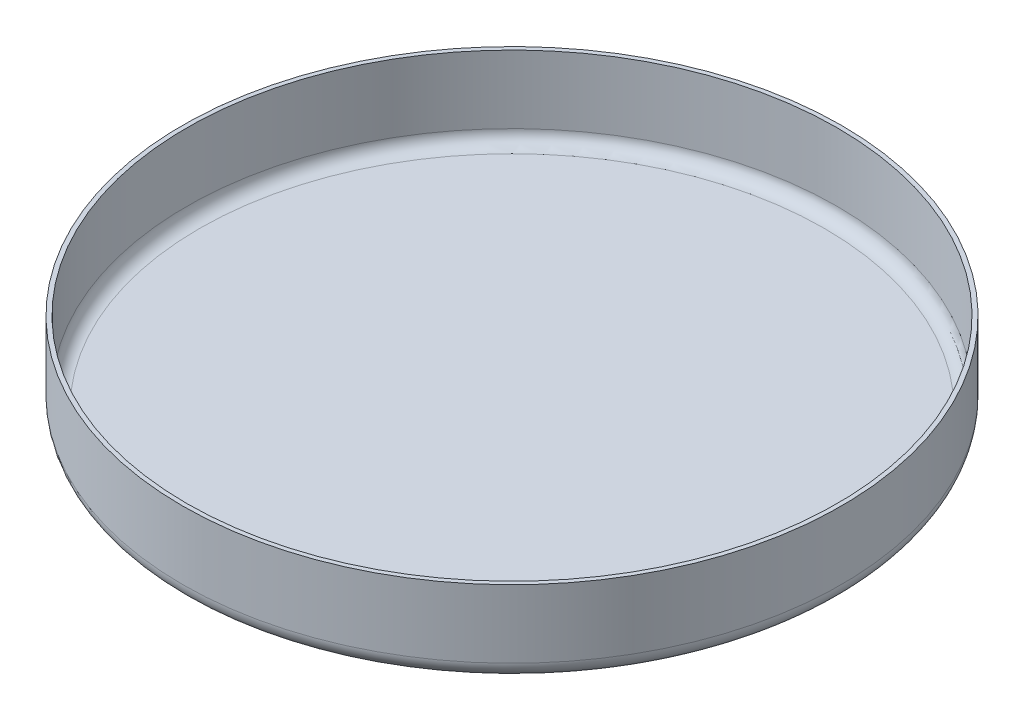
ISO-10303-21;
HEADER;
FILE_DESCRIPTION(('STEP AP214'),'2;1');
FILE_NAME('part.step','',(''),(''),'','','');
FILE_SCHEMA(('AUTOMOTIVE_DESIGN { 1 0 10303 214 1 1 1 1 }'));
ENDSEC;
DATA;
#1=APPLICATION_CONTEXT('core data for automotive mechanical design processes');
#2=APPLICATION_PROTOCOL_DEFINITION('international standard','automotive_design',2000,#1);
#3=PRODUCT_CONTEXT('',#1,'mechanical');
#4=PRODUCT('Part','Part','',(#3));
#5=PRODUCT_RELATED_PRODUCT_CATEGORY('part','',(#4));
#6=PRODUCT_DEFINITION_FORMATION('','',#4);
#7=PRODUCT_DEFINITION_CONTEXT('part definition',#1,'design');
#8=PRODUCT_DEFINITION('design','',#6,#7);
#9=PRODUCT_DEFINITION_SHAPE('','',#8);
#10=(LENGTH_UNIT() NAMED_UNIT(*) SI_UNIT(.MILLI.,.METRE.));
#11=(NAMED_UNIT(*) PLANE_ANGLE_UNIT() SI_UNIT($,.RADIAN.));
#12=(NAMED_UNIT(*) SI_UNIT($,.STERADIAN.) SOLID_ANGLE_UNIT());
#13=UNCERTAINTY_MEASURE_WITH_UNIT(LENGTH_MEASURE(1.E-05),#10,'distance_accuracy_value','');
#14=(GEOMETRIC_REPRESENTATION_CONTEXT(3) GLOBAL_UNCERTAINTY_ASSIGNED_CONTEXT((#13)) GLOBAL_UNIT_ASSIGNED_CONTEXT((#10,
#11,#12)) REPRESENTATION_CONTEXT('',''));
#15=CARTESIAN_POINT('',(0.,0.,0.));
#16=DIRECTION('',(0.,0.,1.));
#17=DIRECTION('',(1.,0.,0.));
#18=AXIS2_PLACEMENT_3D('',#15,#16,#17);
#19=CARTESIAN_POINT('',(0.,-0.999999999999995,0.));
#20=DIRECTION('',(0.,1.,0.));
#21=DIRECTION('',(0.,0.,1.));
#22=AXIS2_PLACEMENT_3D('',#19,#20,#21);
#23=PLANE('',#22);
#24=CARTESIAN_POINT('',(0.,-0.999999999999995,0.));
#25=DIRECTION('',(0.,1.,0.));
#26=DIRECTION('',(0.,0.,1.));
#27=AXIS2_PLACEMENT_3D('',#24,#25,#26);
#28=CIRCLE('',#27,73.5);
#29=CARTESIAN_POINT('',(0.,-0.999999999999995,73.5));
#30=VERTEX_POINT('',#29);
#31=EDGE_CURVE('E12',#30,#30,#28,.T.);
#32=ORIENTED_EDGE('',*,*,#31,.F.);
#33=EDGE_LOOP('',(#32));
#34=FACE_BOUND('',#33,.T.);
#35=ADVANCED_FACE('F96',(#34),#23,.F.);
#36=CARTESIAN_POINT('',(0.,19.,0.));
#37=DIRECTION('',(0.,-1.,0.));
#38=DIRECTION('',(0.,0.,-1.));
#39=AXIS2_PLACEMENT_3D('',#36,#37,#38);
#40=PLANE('',#39);
#41=CARTESIAN_POINT('',(0.,19.,0.));
#42=DIRECTION('',(0.,1.,0.));
#43=DIRECTION('',(0.,0.,1.));
#44=AXIS2_PLACEMENT_3D('',#41,#42,#43);
#45=CIRCLE('',#44,77.5);
#46=CARTESIAN_POINT('',(0.,19.,77.5));
#47=VERTEX_POINT('',#46);
#48=EDGE_CURVE('E143',#47,#47,#45,.T.);
#49=ORIENTED_EDGE('',*,*,#48,.T.);
#50=EDGE_LOOP('',(#49));
#51=FACE_BOUND('',#50,.T.);
#52=CARTESIAN_POINT('',(0.,19.,0.));
#53=DIRECTION('',(0.,1.,0.));
#54=DIRECTION('',(0.,0.,1.));
#55=AXIS2_PLACEMENT_3D('',#52,#53,#54);
#56=CIRCLE('',#55,76.5);
#57=CARTESIAN_POINT('',(0.,19.,76.5));
#58=VERTEX_POINT('',#57);
#59=EDGE_CURVE('E144',#58,#58,#56,.T.);
#60=ORIENTED_EDGE('',*,*,#59,.F.);
#61=EDGE_LOOP('',(#60));
#62=FACE_BOUND('',#61,.T.);
#63=ADVANCED_FACE('F167',(#51,#62),#40,.F.);
#64=CARTESIAN_POINT('',(0.,0.,0.));
#65=DIRECTION('',(0.,1.,0.));
#66=DIRECTION('',(0.,0.,1.));
#67=AXIS2_PLACEMENT_3D('',#64,#65,#66);
#68=CYLINDRICAL_SURFACE('',#67,76.5);
#69=DIRECTION('',(0.,1.,0.));
#70=VECTOR('',#69,1.);
#71=CARTESIAN_POINT('',(0.,0.,76.5));
#72=LINE('',#71,#70);
#73=CARTESIAN_POINT('',(0.,3.,76.5));
#74=VERTEX_POINT('',#73);
#75=EDGE_CURVE('E153',#74,#58,#72,.T.);
#76=ORIENTED_EDGE('',*,*,#75,.F.);
#77=CARTESIAN_POINT('',(0.,3.,0.));
#78=DIRECTION('',(0.,1.,0.));
#79=DIRECTION('',(0.,0.,1.));
#80=AXIS2_PLACEMENT_3D('',#77,#78,#79);
#81=CIRCLE('',#80,76.5);
#82=EDGE_CURVE('E145',#74,#74,#81,.T.);
#83=ORIENTED_EDGE('',*,*,#82,.F.);
#84=ORIENTED_EDGE('',*,*,#75,.T.);
#85=ORIENTED_EDGE('',*,*,#59,.T.);
#86=EDGE_LOOP('',(#76,#83,#84,#85));
#87=FACE_BOUND('',#86,.T.);
#88=ADVANCED_FACE('F171',(#87),#68,.F.);
#89=CARTESIAN_POINT('',(0.,3.,0.));
#90=DIRECTION('',(0.,1.,0.));
#91=DIRECTION('',(0.,0.,1.));
#92=AXIS2_PLACEMENT_3D('',#89,#90,#91);
#93=TOROIDAL_SURFACE('',#92,73.5,3.);
#94=CARTESIAN_POINT('',(0.,3.,73.5));
#95=DIRECTION('',(1.,0.,0.));
#96=DIRECTION('',(0.,0.,-1.));
#97=AXIS2_PLACEMENT_3D('',#94,#95,#96);
#98=CIRCLE('',#97,3.);
#99=CARTESIAN_POINT('',(0.,0.,73.5));
#100=VERTEX_POINT('',#99);
#101=EDGE_CURVE('E111',#100,#74,#98,.F.);
#102=ORIENTED_EDGE('',*,*,#101,.F.);
#103=CARTESIAN_POINT('',(0.,0.,0.));
#104=DIRECTION('',(0.,1.,0.));
#105=DIRECTION('',(0.,0.,1.));
#106=AXIS2_PLACEMENT_3D('',#103,#104,#105);
#107=CIRCLE('',#106,73.5);
#108=EDGE_CURVE('E150',#100,#100,#107,.T.);
#109=ORIENTED_EDGE('',*,*,#108,.F.);
#110=ORIENTED_EDGE('',*,*,#101,.T.);
#111=ORIENTED_EDGE('',*,*,#82,.T.);
#112=EDGE_LOOP('',(#102,#109,#110,#111));
#113=FACE_BOUND('',#112,.T.);
#114=ADVANCED_FACE('F157',(#113),#93,.F.);
#115=CARTESIAN_POINT('',(0.,0.,0.));
#116=DIRECTION('',(0.,1.,0.));
#117=DIRECTION('',(0.,0.,1.));
#118=AXIS2_PLACEMENT_3D('',#115,#116,#117);
#119=CYLINDRICAL_SURFACE('',#118,77.5);
#120=DIRECTION('',(0.,1.,0.));
#121=VECTOR('',#120,1.);
#122=CARTESIAN_POINT('',(0.,0.,77.5));
#123=LINE('',#122,#121);
#124=CARTESIAN_POINT('',(0.,3.,77.5));
#125=VERTEX_POINT('',#124);
#126=EDGE_CURVE('E137',#125,#47,#123,.T.);
#127=ORIENTED_EDGE('',*,*,#126,.T.);
#128=ORIENTED_EDGE('',*,*,#48,.F.);
#129=ORIENTED_EDGE('',*,*,#126,.F.);
#130=CARTESIAN_POINT('',(0.,3.,0.));
#131=DIRECTION('',(0.,1.,0.));
#132=DIRECTION('',(0.,0.,1.));
#133=AXIS2_PLACEMENT_3D('',#130,#131,#132);
#134=CIRCLE('',#133,77.5);
#135=EDGE_CURVE('E135',#125,#125,#134,.T.);
#136=ORIENTED_EDGE('',*,*,#135,.T.);
#137=EDGE_LOOP('',(#127,#128,#129,#136));
#138=FACE_BOUND('',#137,.T.);
#139=ADVANCED_FACE('F164',(#138),#119,.T.);
#140=CARTESIAN_POINT('',(0.,3.,0.));
#141=DIRECTION('',(0.,1.,0.));
#142=DIRECTION('',(0.,0.,1.));
#143=AXIS2_PLACEMENT_3D('',#140,#141,#142);
#144=TOROIDAL_SURFACE('',#143,73.5,3.99999999999999);
#145=CARTESIAN_POINT('',(0.,3.,73.5));
#146=DIRECTION('',(-1.,0.,0.));
#147=DIRECTION('',(0.,0.,1.));
#148=AXIS2_PLACEMENT_3D('',#145,#146,#147);
#149=CIRCLE('',#148,3.99999999999999);
#150=EDGE_CURVE('E132',#30,#125,#149,.T.);
#151=ORIENTED_EDGE('',*,*,#150,.T.);
#152=ORIENTED_EDGE('',*,*,#135,.F.);
#153=ORIENTED_EDGE('',*,*,#150,.F.);
#154=ORIENTED_EDGE('',*,*,#31,.T.);
#155=EDGE_LOOP('',(#151,#152,#153,#154));
#156=FACE_BOUND('',#155,.T.);
#157=ADVANCED_FACE('F133',(#156),#144,.T.);
#158=CARTESIAN_POINT('',(0.,0.,0.));
#159=DIRECTION('',(0.,1.,0.));
#160=DIRECTION('',(0.,0.,1.));
#161=AXIS2_PLACEMENT_3D('',#158,#159,#160);
#162=PLANE('',#161);
#163=ORIENTED_EDGE('',*,*,#108,.T.);
#164=EDGE_LOOP('',(#163));
#165=FACE_BOUND('',#164,.T.);
#166=ADVANCED_FACE('F98',(#165),#162,.T.);
#167=CLOSED_SHELL('',(#35,#63,#88,#114,#139,#157,#166));
#168=MANIFOLD_SOLID_BREP('B2',#167);
#169=ADVANCED_BREP_SHAPE_REPRESENTATION('',(#18,#168),#14);
#170=SHAPE_DEFINITION_REPRESENTATION(#9,#169);
ENDSEC;
END-ISO-10303-21;
